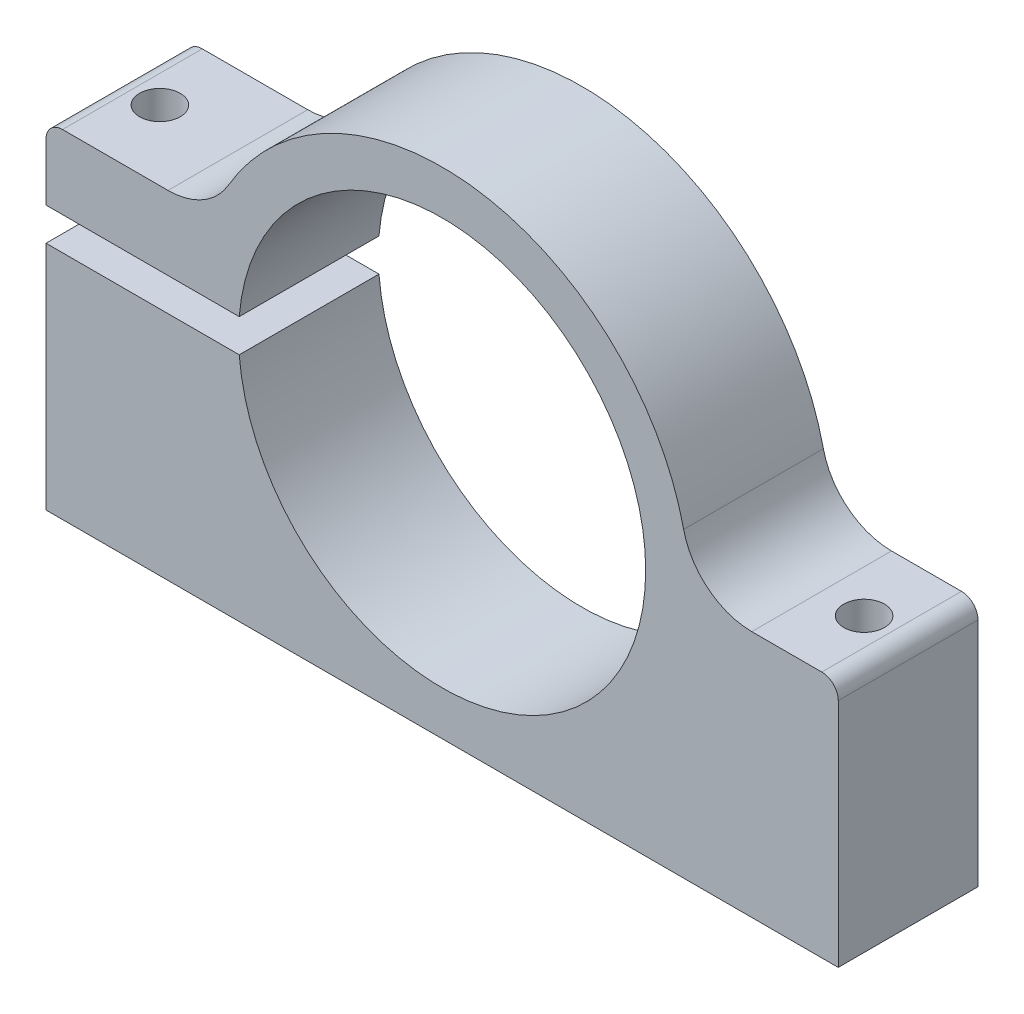
ISO-10303-21;
HEADER;
FILE_DESCRIPTION(('STEP AP214'),'2;1');
FILE_NAME('part.step','',(''),(''),'','','');
FILE_SCHEMA(('AUTOMOTIVE_DESIGN { 1 0 10303 214 1 1 1 1 }'));
ENDSEC;
DATA;
#1=APPLICATION_CONTEXT('core data for automotive mechanical design processes');
#2=APPLICATION_PROTOCOL_DEFINITION('international standard','automotive_design',2000,#1);
#3=PRODUCT_CONTEXT('',#1,'mechanical');
#4=PRODUCT('Part','Part','',(#3));
#5=PRODUCT_RELATED_PRODUCT_CATEGORY('part','',(#4));
#6=PRODUCT_DEFINITION_FORMATION('','',#4);
#7=PRODUCT_DEFINITION_CONTEXT('part definition',#1,'design');
#8=PRODUCT_DEFINITION('design','',#6,#7);
#9=PRODUCT_DEFINITION_SHAPE('','',#8);
#10=(LENGTH_UNIT() NAMED_UNIT(*) SI_UNIT(.MILLI.,.METRE.));
#11=(NAMED_UNIT(*) PLANE_ANGLE_UNIT() SI_UNIT($,.RADIAN.));
#12=(NAMED_UNIT(*) SI_UNIT($,.STERADIAN.) SOLID_ANGLE_UNIT());
#13=UNCERTAINTY_MEASURE_WITH_UNIT(LENGTH_MEASURE(1.E-05),#10,'distance_accuracy_value','');
#14=(GEOMETRIC_REPRESENTATION_CONTEXT(3) GLOBAL_UNCERTAINTY_ASSIGNED_CONTEXT((#13)) GLOBAL_UNIT_ASSIGNED_CONTEXT((#10,
#11,#12)) REPRESENTATION_CONTEXT('',''));
#15=CARTESIAN_POINT('',(0.,0.,0.));
#16=DIRECTION('',(0.,0.,1.));
#17=DIRECTION('',(1.,0.,0.));
#18=AXIS2_PLACEMENT_3D('',#15,#16,#17);
#19=CARTESIAN_POINT('',(32.,0.,0.));
#20=DIRECTION('',(0.,-1.,0.));
#21=DIRECTION('',(0.,0.,-1.));
#22=AXIS2_PLACEMENT_3D('',#19,#20,#21);
#23=CYLINDRICAL_SURFACE('',#22,1.85);
#24=CARTESIAN_POINT('',(32.,0.,0.));
#25=DIRECTION('',(0.,-1.,0.));
#26=DIRECTION('',(0.,0.,-1.));
#27=AXIS2_PLACEMENT_3D('',#24,#25,#26);
#28=CIRCLE('',#27,1.85);
#29=CARTESIAN_POINT('',(32.,0.,-1.85));
#30=VERTEX_POINT('',#29);
#31=EDGE_CURVE('E21',#30,#30,#28,.T.);
#32=ORIENTED_EDGE('',*,*,#31,.F.);
#33=EDGE_LOOP('',(#32));
#34=FACE_BOUND('',#33,.T.);
#35=CARTESIAN_POINT('',(32.,-22.5,0.));
#36=DIRECTION('',(0.,-1.,0.));
#37=DIRECTION('',(0.,0.,-1.));
#38=AXIS2_PLACEMENT_3D('',#35,#36,#37);
#39=CIRCLE('',#38,1.85);
#40=CARTESIAN_POINT('',(32.,-22.5,-1.85));
#41=VERTEX_POINT('',#40);
#42=EDGE_CURVE('E141',#41,#41,#39,.F.);
#43=ORIENTED_EDGE('',*,*,#42,.F.);
#44=EDGE_LOOP('',(#43));
#45=FACE_BOUND('',#44,.T.);
#46=ADVANCED_FACE('F18',(#34,#45),#23,.F.);
#47=CARTESIAN_POINT('',(-32.,8.2,0.));
#48=DIRECTION('',(0.,-1.,0.));
#49=DIRECTION('',(0.,0.,-1.));
#50=AXIS2_PLACEMENT_3D('',#47,#48,#49);
#51=CYLINDRICAL_SURFACE('',#50,1.85);
#52=CARTESIAN_POINT('',(-32.,-1.5,0.));
#53=DIRECTION('',(0.,-1.,0.));
#54=DIRECTION('',(0.,0.,-1.));
#55=AXIS2_PLACEMENT_3D('',#52,#53,#54);
#56=CIRCLE('',#55,1.85);
#57=CARTESIAN_POINT('',(-32.,-1.5,-1.85));
#58=VERTEX_POINT('',#57);
#59=EDGE_CURVE('E130',#58,#58,#56,.F.);
#60=ORIENTED_EDGE('',*,*,#59,.T.);
#61=EDGE_LOOP('',(#60));
#62=FACE_BOUND('',#61,.T.);
#63=CARTESIAN_POINT('',(-32.,-22.5,0.));
#64=DIRECTION('',(0.,-1.,0.));
#65=DIRECTION('',(0.,0.,-1.));
#66=AXIS2_PLACEMENT_3D('',#63,#64,#65);
#67=CIRCLE('',#66,1.85);
#68=CARTESIAN_POINT('',(-32.,-22.5,-1.85));
#69=VERTEX_POINT('',#68);
#70=EDGE_CURVE('E137',#69,#69,#67,.F.);
#71=ORIENTED_EDGE('',*,*,#70,.F.);
#72=EDGE_LOOP('',(#71));
#73=FACE_BOUND('',#72,.T.);
#74=ADVANCED_FACE('F468',(#62,#73),#51,.F.);
#75=CARTESIAN_POINT('',(-32.,8.2,0.));
#76=DIRECTION('',(0.,-1.,0.));
#77=DIRECTION('',(0.,0.,-1.));
#78=AXIS2_PLACEMENT_3D('',#75,#76,#77);
#79=CYLINDRICAL_SURFACE('',#78,1.85);
#80=CARTESIAN_POINT('',(-32.,8.2,0.));
#81=DIRECTION('',(0.,-1.,0.));
#82=DIRECTION('',(0.,0.,-1.));
#83=AXIS2_PLACEMENT_3D('',#80,#81,#82);
#84=CIRCLE('',#83,1.85);
#85=CARTESIAN_POINT('',(-32.,8.2,-1.85));
#86=VERTEX_POINT('',#85);
#87=EDGE_CURVE('E144',#86,#86,#84,.T.);
#88=ORIENTED_EDGE('',*,*,#87,.F.);
#89=EDGE_LOOP('',(#88));
#90=FACE_BOUND('',#89,.T.);
#91=CARTESIAN_POINT('',(-32.,1.5,0.));
#92=DIRECTION('',(0.,-1.,0.));
#93=DIRECTION('',(0.,0.,-1.));
#94=AXIS2_PLACEMENT_3D('',#91,#92,#93);
#95=CIRCLE('',#94,1.85);
#96=CARTESIAN_POINT('',(-32.,1.5,-1.85));
#97=VERTEX_POINT('',#96);
#98=EDGE_CURVE('E191',#97,#97,#95,.T.);
#99=ORIENTED_EDGE('',*,*,#98,.T.);
#100=EDGE_LOOP('',(#99));
#101=FACE_BOUND('',#100,.T.);
#102=ADVANCED_FACE('F460',(#90,#101),#79,.F.);
#103=CARTESIAN_POINT('',(34.5,-1.5,22.90572));
#104=DIRECTION('',(0.,0.,-1.));
#105=DIRECTION('',(-1.,0.,0.));
#106=AXIS2_PLACEMENT_3D('',#103,#104,#105);
#107=CYLINDRICAL_SURFACE('',#106,1.5);
#108=CARTESIAN_POINT('',(34.5,-1.5,6.35));
#109=DIRECTION('',(0.,0.,-1.));
#110=DIRECTION('',(-1.,0.,0.));
#111=AXIS2_PLACEMENT_3D('',#108,#109,#110);
#112=CIRCLE('',#111,1.5);
#113=CARTESIAN_POINT('',(36.,-1.5,6.35));
#114=VERTEX_POINT('',#113);
#115=CARTESIAN_POINT('',(34.5,0.,6.35));
#116=VERTEX_POINT('',#115);
#117=EDGE_CURVE('E189',#114,#116,#112,.F.);
#118=ORIENTED_EDGE('',*,*,#117,.F.);
#119=DIRECTION('',(0.,0.,-1.));
#120=VECTOR('',#119,1.);
#121=CARTESIAN_POINT('',(36.,-1.5,-6.35));
#122=LINE('',#121,#120);
#123=CARTESIAN_POINT('',(36.,-1.5,-6.35));
#124=VERTEX_POINT('',#123);
#125=EDGE_CURVE('E140',#124,#114,#122,.F.);
#126=ORIENTED_EDGE('',*,*,#125,.F.);
#127=CARTESIAN_POINT('',(34.5,-1.5,-6.35));
#128=DIRECTION('',(0.,0.,-1.));
#129=DIRECTION('',(-1.,0.,0.));
#130=AXIS2_PLACEMENT_3D('',#127,#128,#129);
#131=CIRCLE('',#130,1.5);
#132=CARTESIAN_POINT('',(34.5,0.,-6.35));
#133=VERTEX_POINT('',#132);
#134=EDGE_CURVE('E195',#124,#133,#131,.F.);
#135=ORIENTED_EDGE('',*,*,#134,.T.);
#136=DIRECTION('',(0.,0.,1.));
#137=VECTOR('',#136,1.);
#138=CARTESIAN_POINT('',(34.5,0.,-6.35));
#139=LINE('',#138,#137);
#140=EDGE_CURVE('E161',#116,#133,#139,.F.);
#141=ORIENTED_EDGE('',*,*,#140,.F.);
#142=EDGE_LOOP('',(#118,#126,#135,#141));
#143=FACE_BOUND('',#142,.T.);
#144=ADVANCED_FACE('F318',(#143),#107,.T.);
#145=CARTESIAN_POINT('',(36.,0.,-6.35));
#146=DIRECTION('',(0.,1.,0.));
#147=DIRECTION('',(0.,0.,1.));
#148=AXIS2_PLACEMENT_3D('',#145,#146,#147);
#149=PLANE('',#148);
#150=ORIENTED_EDGE('',*,*,#31,.T.);
#151=EDGE_LOOP('',(#150));
#152=FACE_BOUND('',#151,.T.);
#153=DIRECTION('',(0.,0.,1.));
#154=VECTOR('',#153,1.);
#155=CARTESIAN_POINT('',(28.1424945589406,0.,-22.90572));
#156=LINE('',#155,#154);
#157=CARTESIAN_POINT('',(28.1424945589406,0.,-6.35));
#158=VERTEX_POINT('',#157);
#159=CARTESIAN_POINT('',(28.1424945589406,0.,6.35));
#160=VERTEX_POINT('',#159);
#161=EDGE_CURVE('E101',#158,#160,#156,.T.);
#162=ORIENTED_EDGE('',*,*,#161,.T.);
#163=DIRECTION('',(1.,0.,0.));
#164=VECTOR('',#163,1.);
#165=CARTESIAN_POINT('',(0.,0.,6.35));
#166=LINE('',#165,#164);
#167=EDGE_CURVE('E188',#116,#160,#166,.F.);
#168=ORIENTED_EDGE('',*,*,#167,.F.);
#169=ORIENTED_EDGE('',*,*,#140,.T.);
#170=DIRECTION('',(1.,0.,0.));
#171=VECTOR('',#170,1.);
#172=CARTESIAN_POINT('',(0.,0.,-6.35));
#173=LINE('',#172,#171);
#174=EDGE_CURVE('E128',#133,#158,#173,.F.);
#175=ORIENTED_EDGE('',*,*,#174,.T.);
#176=EDGE_LOOP('',(#162,#168,#169,#175));
#177=FACE_BOUND('',#176,.T.);
#178=ADVANCED_FACE('F321',(#152,#177),#149,.T.);
#179=CARTESIAN_POINT('',(28.1424945589406,6.35,-22.90572));
#180=DIRECTION('',(0.,0.,1.));
#181=DIRECTION('',(1.,0.,0.));
#182=AXIS2_PLACEMENT_3D('',#179,#180,#181);
#183=CYLINDRICAL_SURFACE('',#182,6.35);
#184=CARTESIAN_POINT('',(28.1424945589406,6.35,6.35));
#185=DIRECTION('',(0.,0.,1.));
#186=DIRECTION('',(1.,0.,0.));
#187=AXIS2_PLACEMENT_3D('',#184,#185,#186);
#188=CIRCLE('',#187,6.35);
#189=CARTESIAN_POINT('',(21.9482193267301,4.9523396880416,6.35));
#190=VERTEX_POINT('',#189);
#191=EDGE_CURVE('E186',#160,#190,#188,.F.);
#192=ORIENTED_EDGE('',*,*,#191,.F.);
#193=ORIENTED_EDGE('',*,*,#161,.F.);
#194=CARTESIAN_POINT('',(28.1424945589406,6.35,-6.35));
#195=DIRECTION('',(0.,0.,1.));
#196=DIRECTION('',(1.,0.,0.));
#197=AXIS2_PLACEMENT_3D('',#194,#195,#196);
#198=CIRCLE('',#197,6.35);
#199=CARTESIAN_POINT('',(21.9482193267301,4.95233968804159,-6.35));
#200=VERTEX_POINT('',#199);
#201=EDGE_CURVE('E121',#158,#200,#198,.F.);
#202=ORIENTED_EDGE('',*,*,#201,.T.);
#203=DIRECTION('',(0.,0.,1.));
#204=VECTOR('',#203,1.);
#205=CARTESIAN_POINT('',(21.9482193267301,4.9523396880416,-6.35));
#206=LINE('',#205,#204);
#207=EDGE_CURVE('E108',#190,#200,#206,.F.);
#208=ORIENTED_EDGE('',*,*,#207,.F.);
#209=EDGE_LOOP('',(#192,#193,#202,#208));
#210=FACE_BOUND('',#209,.T.);
#211=ADVANCED_FACE('F127',(#210),#183,.F.);
#212=CARTESIAN_POINT('',(0.,0.,-6.35));
#213=DIRECTION('',(0.,0.,1.));
#214=DIRECTION('',(1.,0.,0.));
#215=AXIS2_PLACEMENT_3D('',#212,#213,#214);
#216=CYLINDRICAL_SURFACE('',#215,22.5);
#217=DIRECTION('',(0.,0.,1.));
#218=VECTOR('',#217,1.);
#219=CARTESIAN_POINT('',(-19.428961339853,11.347487001733,-22.90572));
#220=LINE('',#219,#218);
#221=CARTESIAN_POINT('',(-19.4289613398529,11.347487001733,-6.35));
#222=VERTEX_POINT('',#221);
#223=CARTESIAN_POINT('',(-19.4289613398529,11.347487001733,6.35));
#224=VERTEX_POINT('',#223);
#225=EDGE_CURVE('E114',#222,#224,#220,.T.);
#226=ORIENTED_EDGE('',*,*,#225,.T.);
#227=CARTESIAN_POINT('',(0.,0.,6.35));
#228=DIRECTION('',(0.,0.,1.));
#229=DIRECTION('',(1.,0.,0.));
#230=AXIS2_PLACEMENT_3D('',#227,#228,#229);
#231=CIRCLE('',#230,22.5);
#232=EDGE_CURVE('E113',#190,#224,#231,.T.);
#233=ORIENTED_EDGE('',*,*,#232,.F.);
#234=ORIENTED_EDGE('',*,*,#207,.T.);
#235=CARTESIAN_POINT('',(0.,0.,-6.35));
#236=DIRECTION('',(0.,0.,1.));
#237=DIRECTION('',(1.,0.,0.));
#238=AXIS2_PLACEMENT_3D('',#235,#236,#237);
#239=CIRCLE('',#238,22.5);
#240=EDGE_CURVE('E112',#200,#222,#239,.T.);
#241=ORIENTED_EDGE('',*,*,#240,.T.);
#242=EDGE_LOOP('',(#226,#233,#234,#241));
#243=FACE_BOUND('',#242,.T.);
#244=ADVANCED_FACE('F111',(#243),#216,.T.);
#245=CARTESIAN_POINT('',(-24.9122459846558,14.55,-22.90572));
#246=DIRECTION('',(0.,0.,1.));
#247=DIRECTION('',(1.,0.,0.));
#248=AXIS2_PLACEMENT_3D('',#245,#246,#247);
#249=CYLINDRICAL_SURFACE('',#248,6.35);
#250=CARTESIAN_POINT('',(-24.9122459846558,14.55,6.35));
#251=DIRECTION('',(0.,0.,1.));
#252=DIRECTION('',(1.,0.,0.));
#253=AXIS2_PLACEMENT_3D('',#250,#251,#252);
#254=CIRCLE('',#253,6.35);
#255=CARTESIAN_POINT('',(-24.9122459846558,8.2,6.35));
#256=VERTEX_POINT('',#255);
#257=EDGE_CURVE('E183',#224,#256,#254,.F.);
#258=ORIENTED_EDGE('',*,*,#257,.F.);
#259=ORIENTED_EDGE('',*,*,#225,.F.);
#260=CARTESIAN_POINT('',(-24.9122459846558,14.55,-6.35));
#261=DIRECTION('',(0.,0.,1.));
#262=DIRECTION('',(1.,0.,0.));
#263=AXIS2_PLACEMENT_3D('',#260,#261,#262);
#264=CIRCLE('',#263,6.35);
#265=CARTESIAN_POINT('',(-24.9122459846558,8.2,-6.35));
#266=VERTEX_POINT('',#265);
#267=EDGE_CURVE('E125',#222,#266,#264,.F.);
#268=ORIENTED_EDGE('',*,*,#267,.T.);
#269=DIRECTION('',(0.,0.,1.));
#270=VECTOR('',#269,1.);
#271=CARTESIAN_POINT('',(-24.9122459846558,8.2,-6.35));
#272=LINE('',#271,#270);
#273=EDGE_CURVE('E147',#256,#266,#272,.F.);
#274=ORIENTED_EDGE('',*,*,#273,.F.);
#275=EDGE_LOOP('',(#258,#259,#268,#274));
#276=FACE_BOUND('',#275,.T.);
#277=ADVANCED_FACE('F323',(#276),#249,.F.);
#278=CARTESIAN_POINT('',(-20.952565475378,8.2,-6.35));
#279=DIRECTION('',(0.,1.,0.));
#280=DIRECTION('',(0.,0.,1.));
#281=AXIS2_PLACEMENT_3D('',#278,#279,#280);
#282=PLANE('',#281);
#283=ORIENTED_EDGE('',*,*,#87,.T.);
#284=EDGE_LOOP('',(#283));
#285=FACE_BOUND('',#284,.T.);
#286=ORIENTED_EDGE('',*,*,#273,.T.);
#287=DIRECTION('',(1.,0.,0.));
#288=VECTOR('',#287,1.);
#289=CARTESIAN_POINT('',(0.,8.2,-6.35));
#290=LINE('',#289,#288);
#291=CARTESIAN_POINT('',(-34.5,8.2,-6.35));
#292=VERTEX_POINT('',#291);
#293=EDGE_CURVE('E202',#266,#292,#290,.F.);
#294=ORIENTED_EDGE('',*,*,#293,.T.);
#295=DIRECTION('',(0.,0.,-1.));
#296=VECTOR('',#295,1.);
#297=CARTESIAN_POINT('',(-34.5,8.2,22.90572));
#298=LINE('',#297,#296);
#299=CARTESIAN_POINT('',(-34.5,8.2,6.35));
#300=VERTEX_POINT('',#299);
#301=EDGE_CURVE('E146',#300,#292,#298,.T.);
#302=ORIENTED_EDGE('',*,*,#301,.F.);
#303=DIRECTION('',(1.,0.,0.));
#304=VECTOR('',#303,1.);
#305=CARTESIAN_POINT('',(0.,8.2,6.35));
#306=LINE('',#305,#304);
#307=EDGE_CURVE('E182',#256,#300,#306,.F.);
#308=ORIENTED_EDGE('',*,*,#307,.F.);
#309=EDGE_LOOP('',(#286,#294,#302,#308));
#310=FACE_BOUND('',#309,.T.);
#311=ADVANCED_FACE('F250',(#285,#310),#282,.T.);
#312=CARTESIAN_POINT('',(-34.5,6.7,22.90572));
#313=DIRECTION('',(0.,0.,-1.));
#314=DIRECTION('',(-1.,0.,0.));
#315=AXIS2_PLACEMENT_3D('',#312,#313,#314);
#316=CYLINDRICAL_SURFACE('',#315,1.5);
#317=CARTESIAN_POINT('',(-34.5,6.7,6.35));
#318=DIRECTION('',(0.,0.,-1.));
#319=DIRECTION('',(-1.,0.,0.));
#320=AXIS2_PLACEMENT_3D('',#317,#318,#319);
#321=CIRCLE('',#320,1.5);
#322=CARTESIAN_POINT('',(-36.,6.7,6.35));
#323=VERTEX_POINT('',#322);
#324=EDGE_CURVE('E179',#300,#323,#321,.F.);
#325=ORIENTED_EDGE('',*,*,#324,.F.);
#326=ORIENTED_EDGE('',*,*,#301,.T.);
#327=CARTESIAN_POINT('',(-34.5,6.7,-6.35));
#328=DIRECTION('',(0.,0.,-1.));
#329=DIRECTION('',(-1.,0.,0.));
#330=AXIS2_PLACEMENT_3D('',#327,#328,#329);
#331=CIRCLE('',#330,1.5);
#332=CARTESIAN_POINT('',(-36.,6.7,-6.35));
#333=VERTEX_POINT('',#332);
#334=EDGE_CURVE('E199',#292,#333,#331,.F.);
#335=ORIENTED_EDGE('',*,*,#334,.T.);
#336=DIRECTION('',(0.,0.,1.));
#337=VECTOR('',#336,1.);
#338=CARTESIAN_POINT('',(-36.,6.7,-6.35));
#339=LINE('',#338,#337);
#340=EDGE_CURVE('E150',#323,#333,#339,.F.);
#341=ORIENTED_EDGE('',*,*,#340,.F.);
#342=EDGE_LOOP('',(#325,#326,#335,#341));
#343=FACE_BOUND('',#342,.T.);
#344=ADVANCED_FACE('F249',(#343),#316,.T.);
#345=CARTESIAN_POINT('',(-36.,8.2,-6.35));
#346=DIRECTION('',(-1.,0.,0.));
#347=DIRECTION('',(0.,0.,1.));
#348=AXIS2_PLACEMENT_3D('',#345,#346,#347);
#349=PLANE('',#348);
#350=DIRECTION('',(0.,0.,1.));
#351=VECTOR('',#350,1.);
#352=CARTESIAN_POINT('',(-36.,1.5,-7.62));
#353=LINE('',#352,#351);
#354=CARTESIAN_POINT('',(-36.,1.5,-6.35));
#355=VERTEX_POINT('',#354);
#356=CARTESIAN_POINT('',(-36.,1.5,6.35));
#357=VERTEX_POINT('',#356);
#358=EDGE_CURVE('E198',#355,#357,#353,.T.);
#359=ORIENTED_EDGE('',*,*,#358,.T.);
#360=DIRECTION('',(0.,1.,0.));
#361=VECTOR('',#360,1.);
#362=CARTESIAN_POINT('',(-36.,0.,6.35));
#363=LINE('',#362,#361);
#364=EDGE_CURVE('E181',#323,#357,#363,.F.);
#365=ORIENTED_EDGE('',*,*,#364,.F.);
#366=ORIENTED_EDGE('',*,*,#340,.T.);
#367=DIRECTION('',(0.,1.,0.));
#368=VECTOR('',#367,1.);
#369=CARTESIAN_POINT('',(-36.,0.,-6.35));
#370=LINE('',#369,#368);
#371=EDGE_CURVE('E201',#333,#355,#370,.F.);
#372=ORIENTED_EDGE('',*,*,#371,.T.);
#373=EDGE_LOOP('',(#359,#365,#366,#372));
#374=FACE_BOUND('',#373,.T.);
#375=ADVANCED_FACE('F244',(#374),#349,.T.);
#376=CARTESIAN_POINT('',(-36.,8.2,-6.35));
#377=DIRECTION('',(-1.,0.,0.));
#378=DIRECTION('',(0.,0.,1.));
#379=AXIS2_PLACEMENT_3D('',#376,#377,#378);
#380=PLANE('',#379);
#381=DIRECTION('',(0.,0.,-1.));
#382=VECTOR('',#381,1.);
#383=CARTESIAN_POINT('',(-36.,-22.5,-6.35));
#384=LINE('',#383,#382);
#385=CARTESIAN_POINT('',(-36.,-22.5,6.35));
#386=VERTEX_POINT('',#385);
#387=CARTESIAN_POINT('',(-36.,-22.5,-6.35));
#388=VERTEX_POINT('',#387);
#389=EDGE_CURVE('E143',#386,#388,#384,.T.);
#390=ORIENTED_EDGE('',*,*,#389,.F.);
#391=DIRECTION('',(0.,1.,0.));
#392=VECTOR('',#391,1.);
#393=CARTESIAN_POINT('',(-36.,0.,6.35));
#394=LINE('',#393,#392);
#395=CARTESIAN_POINT('',(-36.,-1.5,6.35));
#396=VERTEX_POINT('',#395);
#397=EDGE_CURVE('E220',#396,#386,#394,.F.);
#398=ORIENTED_EDGE('',*,*,#397,.F.);
#399=DIRECTION('',(0.,0.,-1.));
#400=VECTOR('',#399,1.);
#401=CARTESIAN_POINT('',(-36.,-1.5,-7.62));
#402=LINE('',#401,#400);
#403=CARTESIAN_POINT('',(-36.,-1.5,-6.35));
#404=VERTEX_POINT('',#403);
#405=EDGE_CURVE('E136',#396,#404,#402,.T.);
#406=ORIENTED_EDGE('',*,*,#405,.T.);
#407=DIRECTION('',(0.,1.,0.));
#408=VECTOR('',#407,1.);
#409=CARTESIAN_POINT('',(-36.,0.,-6.35));
#410=LINE('',#409,#408);
#411=EDGE_CURVE('E167',#404,#388,#410,.F.);
#412=ORIENTED_EDGE('',*,*,#411,.T.);
#413=EDGE_LOOP('',(#390,#398,#406,#412));
#414=FACE_BOUND('',#413,.T.);
#415=ADVANCED_FACE('F301',(#414),#380,.T.);
#416=CARTESIAN_POINT('',(-36.,-22.5,-6.35));
#417=DIRECTION('',(0.,-1.,0.));
#418=DIRECTION('',(0.,0.,-1.));
#419=AXIS2_PLACEMENT_3D('',#416,#417,#418);
#420=PLANE('',#419);
#421=ORIENTED_EDGE('',*,*,#70,.T.);
#422=EDGE_LOOP('',(#421));
#423=FACE_BOUND('',#422,.T.);
#424=ORIENTED_EDGE('',*,*,#42,.T.);
#425=EDGE_LOOP('',(#424));
#426=FACE_BOUND('',#425,.T.);
#427=DIRECTION('',(1.,0.,0.));
#428=VECTOR('',#427,1.);
#429=CARTESIAN_POINT('',(0.,-22.5,6.35));
#430=LINE('',#429,#428);
#431=CARTESIAN_POINT('',(36.,-22.5,6.35));
#432=VERTEX_POINT('',#431);
#433=EDGE_CURVE('E216',#386,#432,#430,.T.);
#434=ORIENTED_EDGE('',*,*,#433,.F.);
#435=ORIENTED_EDGE('',*,*,#389,.T.);
#436=DIRECTION('',(1.,0.,0.));
#437=VECTOR('',#436,1.);
#438=CARTESIAN_POINT('',(0.,-22.5,-6.35));
#439=LINE('',#438,#437);
#440=CARTESIAN_POINT('',(36.,-22.5,-6.35));
#441=VERTEX_POINT('',#440);
#442=EDGE_CURVE('E163',#388,#441,#439,.T.);
#443=ORIENTED_EDGE('',*,*,#442,.T.);
#444=DIRECTION('',(0.,0.,-1.));
#445=VECTOR('',#444,1.);
#446=CARTESIAN_POINT('',(36.,-22.5,-6.35));
#447=LINE('',#446,#445);
#448=EDGE_CURVE('E211',#432,#441,#447,.T.);
#449=ORIENTED_EDGE('',*,*,#448,.F.);
#450=EDGE_LOOP('',(#434,#435,#443,#449));
#451=FACE_BOUND('',#450,.T.);
#452=ADVANCED_FACE('F296',(#423,#426,#451),#420,.T.);
#453=CARTESIAN_POINT('',(36.,-22.5,-6.35));
#454=DIRECTION('',(1.,0.,0.));
#455=DIRECTION('',(0.,0.,-1.));
#456=AXIS2_PLACEMENT_3D('',#453,#454,#455);
#457=PLANE('',#456);
#458=ORIENTED_EDGE('',*,*,#448,.T.);
#459=DIRECTION('',(0.,1.,0.));
#460=VECTOR('',#459,1.);
#461=CARTESIAN_POINT('',(36.,0.,-6.35));
#462=LINE('',#461,#460);
#463=EDGE_CURVE('E166',#441,#124,#462,.T.);
#464=ORIENTED_EDGE('',*,*,#463,.T.);
#465=ORIENTED_EDGE('',*,*,#125,.T.);
#466=DIRECTION('',(0.,1.,0.));
#467=VECTOR('',#466,1.);
#468=CARTESIAN_POINT('',(36.,0.,6.35));
#469=LINE('',#468,#467);
#470=EDGE_CURVE('E219',#432,#114,#469,.T.);
#471=ORIENTED_EDGE('',*,*,#470,.F.);
#472=EDGE_LOOP('',(#458,#464,#465,#471));
#473=FACE_BOUND('',#472,.T.);
#474=ADVANCED_FACE('F347',(#473),#457,.T.);
#475=CARTESIAN_POINT('',(-36.,-1.5,-7.62));
#476=DIRECTION('',(0.,-1.,0.));
#477=DIRECTION('',(0.,0.,-1.));
#478=AXIS2_PLACEMENT_3D('',#475,#476,#477);
#479=PLANE('',#478);
#480=ORIENTED_EDGE('',*,*,#59,.F.);
#481=EDGE_LOOP('',(#480));
#482=FACE_BOUND('',#481,.T.);
#483=ORIENTED_EDGE('',*,*,#405,.F.);
#484=DIRECTION('',(1.,0.,0.));
#485=VECTOR('',#484,1.);
#486=CARTESIAN_POINT('',(0.,-1.5,6.35));
#487=LINE('',#486,#485);
#488=CARTESIAN_POINT('',(-18.4390889145858,-1.5,6.35));
#489=VERTEX_POINT('',#488);
#490=EDGE_CURVE('E229',#489,#396,#487,.F.);
#491=ORIENTED_EDGE('',*,*,#490,.F.);
#492=DIRECTION('',(0.,0.,1.));
#493=VECTOR('',#492,1.);
#494=CARTESIAN_POINT('',(-18.4390889145858,-1.49999999999999,-7.62));
#495=LINE('',#494,#493);
#496=CARTESIAN_POINT('',(-18.4390889145858,-1.5,-6.35));
#497=VERTEX_POINT('',#496);
#498=EDGE_CURVE('E178',#489,#497,#495,.F.);
#499=ORIENTED_EDGE('',*,*,#498,.T.);
#500=DIRECTION('',(1.,0.,0.));
#501=VECTOR('',#500,1.);
#502=CARTESIAN_POINT('',(0.,-1.5,-6.35));
#503=LINE('',#502,#501);
#504=EDGE_CURVE('E172',#497,#404,#503,.F.);
#505=ORIENTED_EDGE('',*,*,#504,.T.);
#506=EDGE_LOOP('',(#483,#491,#499,#505));
#507=FACE_BOUND('',#506,.T.);
#508=ADVANCED_FACE('F273',(#482,#507),#479,.F.);
#509=CARTESIAN_POINT('',(0.,0.,-6.35));
#510=DIRECTION('',(0.,0.,1.));
#511=DIRECTION('',(1.,0.,0.));
#512=AXIS2_PLACEMENT_3D('',#509,#510,#511);
#513=PLANE('',#512);
#514=ORIENTED_EDGE('',*,*,#463,.F.);
#515=ORIENTED_EDGE('',*,*,#442,.F.);
#516=ORIENTED_EDGE('',*,*,#411,.F.);
#517=ORIENTED_EDGE('',*,*,#504,.F.);
#518=CARTESIAN_POINT('',(0.,0.,-6.35));
#519=DIRECTION('',(0.,0.,1.));
#520=DIRECTION('',(1.,0.,0.));
#521=AXIS2_PLACEMENT_3D('',#518,#519,#520);
#522=CIRCLE('',#521,18.5);
#523=CARTESIAN_POINT('',(-18.4390889145858,1.5,-6.35));
#524=VERTEX_POINT('',#523);
#525=EDGE_CURVE('E175',#497,#524,#522,.T.);
#526=ORIENTED_EDGE('',*,*,#525,.T.);
#527=DIRECTION('',(1.,0.,0.));
#528=VECTOR('',#527,1.);
#529=CARTESIAN_POINT('',(0.,1.5,-6.35));
#530=LINE('',#529,#528);
#531=EDGE_CURVE('E194',#524,#355,#530,.F.);
#532=ORIENTED_EDGE('',*,*,#531,.T.);
#533=ORIENTED_EDGE('',*,*,#371,.F.);
#534=ORIENTED_EDGE('',*,*,#334,.F.);
#535=ORIENTED_EDGE('',*,*,#293,.F.);
#536=ORIENTED_EDGE('',*,*,#267,.F.);
#537=ORIENTED_EDGE('',*,*,#240,.F.);
#538=ORIENTED_EDGE('',*,*,#201,.F.);
#539=ORIENTED_EDGE('',*,*,#174,.F.);
#540=ORIENTED_EDGE('',*,*,#134,.F.);
#541=EDGE_LOOP('',(#514,#515,#516,#517,#526,#532,#533,#534,#535,#536,#537,#538,#539,#540));
#542=FACE_BOUND('',#541,.T.);
#543=ADVANCED_FACE('F119',(#542),#513,.F.);
#544=CARTESIAN_POINT('',(0.,1.5,-7.62));
#545=DIRECTION('',(0.,1.,0.));
#546=DIRECTION('',(0.,0.,1.));
#547=AXIS2_PLACEMENT_3D('',#544,#545,#546);
#548=PLANE('',#547);
#549=ORIENTED_EDGE('',*,*,#98,.F.);
#550=EDGE_LOOP('',(#549));
#551=FACE_BOUND('',#550,.T.);
#552=DIRECTION('',(0.,0.,1.));
#553=VECTOR('',#552,1.);
#554=CARTESIAN_POINT('',(-18.4390889145858,1.49999999999999,-7.62));
#555=LINE('',#554,#553);
#556=CARTESIAN_POINT('',(-18.4390889145858,1.5,6.35));
#557=VERTEX_POINT('',#556);
#558=EDGE_CURVE('E27',#524,#557,#555,.T.);
#559=ORIENTED_EDGE('',*,*,#558,.T.);
#560=DIRECTION('',(1.,0.,0.));
#561=VECTOR('',#560,1.);
#562=CARTESIAN_POINT('',(0.,1.5,6.35));
#563=LINE('',#562,#561);
#564=EDGE_CURVE('E35',#357,#557,#563,.T.);
#565=ORIENTED_EDGE('',*,*,#564,.F.);
#566=ORIENTED_EDGE('',*,*,#358,.F.);
#567=ORIENTED_EDGE('',*,*,#531,.F.);
#568=EDGE_LOOP('',(#559,#565,#566,#567));
#569=FACE_BOUND('',#568,.T.);
#570=ADVANCED_FACE('F286',(#551,#569),#548,.F.);
#571=CARTESIAN_POINT('',(0.,0.,6.35));
#572=DIRECTION('',(0.,0.,1.));
#573=DIRECTION('',(1.,0.,0.));
#574=AXIS2_PLACEMENT_3D('',#571,#572,#573);
#575=PLANE('',#574);
#576=ORIENTED_EDGE('',*,*,#433,.T.);
#577=ORIENTED_EDGE('',*,*,#470,.T.);
#578=ORIENTED_EDGE('',*,*,#117,.T.);
#579=ORIENTED_EDGE('',*,*,#167,.T.);
#580=ORIENTED_EDGE('',*,*,#191,.T.);
#581=ORIENTED_EDGE('',*,*,#232,.T.);
#582=ORIENTED_EDGE('',*,*,#257,.T.);
#583=ORIENTED_EDGE('',*,*,#307,.T.);
#584=ORIENTED_EDGE('',*,*,#324,.T.);
#585=ORIENTED_EDGE('',*,*,#364,.T.);
#586=ORIENTED_EDGE('',*,*,#564,.T.);
#587=CARTESIAN_POINT('',(0.,0.,6.35));
#588=DIRECTION('',(0.,0.,1.));
#589=DIRECTION('',(1.,0.,0.));
#590=AXIS2_PLACEMENT_3D('',#587,#588,#589);
#591=CIRCLE('',#590,18.5);
#592=EDGE_CURVE('E11',#557,#489,#591,.F.);
#593=ORIENTED_EDGE('',*,*,#592,.T.);
#594=ORIENTED_EDGE('',*,*,#490,.T.);
#595=ORIENTED_EDGE('',*,*,#397,.T.);
#596=EDGE_LOOP('',(#576,#577,#578,#579,#580,#581,#582,#583,#584,#585,#586,#593,#594,#595));
#597=FACE_BOUND('',#596,.T.);
#598=ADVANCED_FACE('F302',(#597),#575,.T.);
#599=CARTESIAN_POINT('',(0.,0.,-7.62));
#600=DIRECTION('',(0.,0.,1.));
#601=DIRECTION('',(1.,0.,0.));
#602=AXIS2_PLACEMENT_3D('',#599,#600,#601);
#603=CYLINDRICAL_SURFACE('',#602,18.5);
#604=ORIENTED_EDGE('',*,*,#558,.F.);
#605=ORIENTED_EDGE('',*,*,#525,.F.);
#606=ORIENTED_EDGE('',*,*,#498,.F.);
#607=ORIENTED_EDGE('',*,*,#592,.F.);
#608=EDGE_LOOP('',(#604,#605,#606,#607));
#609=FACE_BOUND('',#608,.T.);
#610=ADVANCED_FACE('F284',(#609),#603,.F.);
#611=CLOSED_SHELL('',(#46,#74,#102,#144,#178,#211,#244,#277,#311,#344,#375,#415,#452,#474,#508,
#543,#570,#598,#610));
#612=MANIFOLD_SOLID_BREP('B1',#611);
#613=ADVANCED_BREP_SHAPE_REPRESENTATION('',(#18,#612),#14);
#614=SHAPE_DEFINITION_REPRESENTATION(#9,#613);
ENDSEC;
END-ISO-10303-21;
